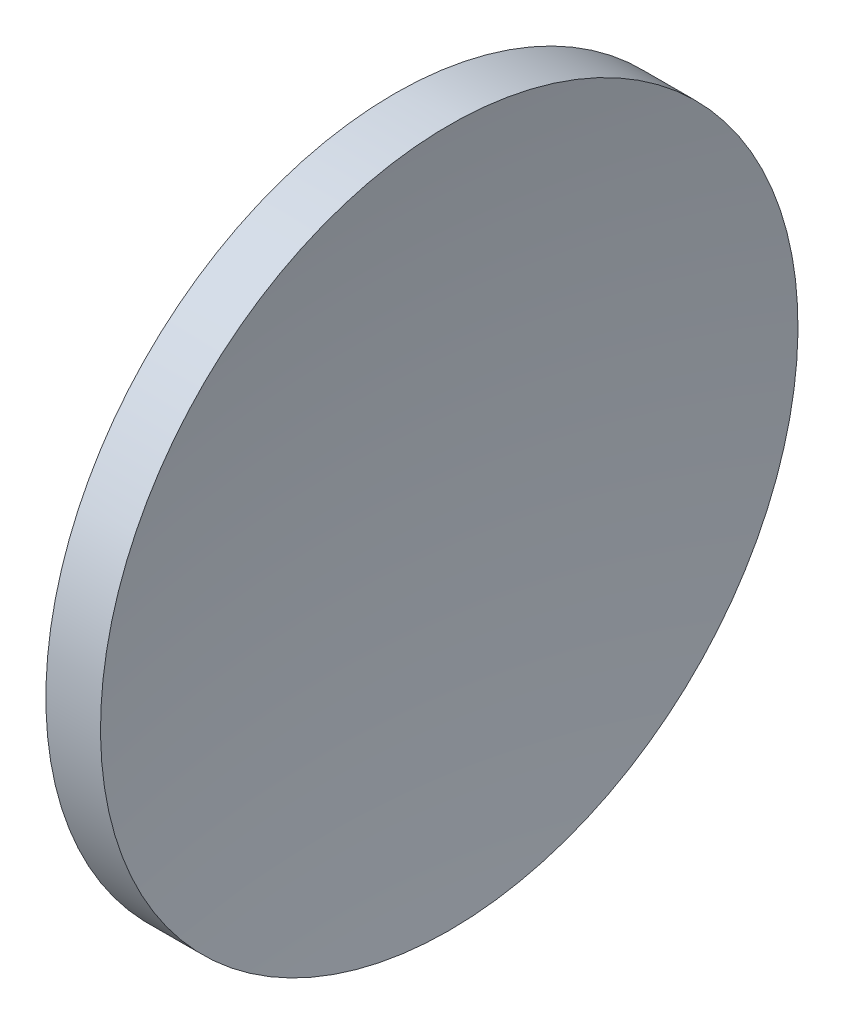
ISO-10303-21;
HEADER;
FILE_DESCRIPTION(('STEP AP214'),'2;1');
FILE_NAME('part.step','',(''),(''),'','','');
FILE_SCHEMA(('AUTOMOTIVE_DESIGN { 1 0 10303 214 1 1 1 1 }'));
ENDSEC;
DATA;
#1=APPLICATION_CONTEXT('core data for automotive mechanical design processes');
#2=APPLICATION_PROTOCOL_DEFINITION('international standard','automotive_design',2000,#1);
#3=PRODUCT_CONTEXT('',#1,'mechanical');
#4=PRODUCT('Part','Part','',(#3));
#5=PRODUCT_RELATED_PRODUCT_CATEGORY('part','',(#4));
#6=PRODUCT_DEFINITION_FORMATION('','',#4);
#7=PRODUCT_DEFINITION_CONTEXT('part definition',#1,'design');
#8=PRODUCT_DEFINITION('design','',#6,#7);
#9=PRODUCT_DEFINITION_SHAPE('','',#8);
#10=(LENGTH_UNIT() NAMED_UNIT(*) SI_UNIT(.MILLI.,.METRE.));
#11=(NAMED_UNIT(*) PLANE_ANGLE_UNIT() SI_UNIT($,.RADIAN.));
#12=(NAMED_UNIT(*) SI_UNIT($,.STERADIAN.) SOLID_ANGLE_UNIT());
#13=UNCERTAINTY_MEASURE_WITH_UNIT(LENGTH_MEASURE(1.E-05),#10,'distance_accuracy_value','');
#14=(GEOMETRIC_REPRESENTATION_CONTEXT(3) GLOBAL_UNCERTAINTY_ASSIGNED_CONTEXT((#13)) GLOBAL_UNIT_ASSIGNED_CONTEXT((#10,
#11,#12)) REPRESENTATION_CONTEXT('',''));
#15=CARTESIAN_POINT('',(0.,0.,0.));
#16=DIRECTION('',(0.,0.,1.));
#17=DIRECTION('',(1.,0.,0.));
#18=AXIS2_PLACEMENT_3D('',#15,#16,#17);
#19=CARTESIAN_POINT('',(249.955421315556,65.2168404709414,0.));
#20=DIRECTION('',(-1.,0.,0.));
#21=DIRECTION('',(0.,-1.,0.));
#22=AXIS2_PLACEMENT_3D('',#19,#20,#21);
#23=SPHERICAL_SURFACE('',#22,121.5);
#24=CARTESIAN_POINT('',(129.954173926206,65.2168404709403,0.));
#25=DIRECTION('',(-1.,0.,0.));
#26=DIRECTION('',(0.,-1.,0.));
#27=AXIS2_PLACEMENT_3D('',#24,#25,#26);
#28=CIRCLE('',#27,19.025);
#29=CARTESIAN_POINT('',(129.954173926206,46.1918404709404,0.));
#30=VERTEX_POINT('',#29);
#31=EDGE_CURVE('E10',#30,#30,#28,.T.);
#32=ORIENTED_EDGE('',*,*,#31,.F.);
#33=EDGE_LOOP('',(#32));
#34=FACE_BOUND('',#33,.T.);
#35=ADVANCED_FACE('F35',(#34),#23,.F.);
#36=CARTESIAN_POINT('',(115.944491297963,65.2168404709403,0.));
#37=DIRECTION('',(-1.,0.,0.));
#38=DIRECTION('',(0.,-1.,0.));
#39=AXIS2_PLACEMENT_3D('',#36,#37,#38);
#40=CYLINDRICAL_SURFACE('',#39,19.025);
#41=CARTESIAN_POINT('',(126.974048666131,65.2168404709403,0.));
#42=DIRECTION('',(-1.,0.,0.));
#43=DIRECTION('',(0.,-1.,0.));
#44=AXIS2_PLACEMENT_3D('',#41,#42,#43);
#45=CIRCLE('',#44,19.025);
#46=CARTESIAN_POINT('',(126.974048666131,46.1918404709403,0.));
#47=VERTEX_POINT('',#46);
#48=EDGE_CURVE('E41',#47,#47,#45,.T.);
#49=ORIENTED_EDGE('',*,*,#48,.F.);
#50=EDGE_LOOP('',(#49));
#51=FACE_BOUND('',#50,.T.);
#52=ORIENTED_EDGE('',*,*,#31,.T.);
#53=EDGE_LOOP('',(#52));
#54=FACE_BOUND('',#53,.T.);
#55=ADVANCED_FACE('F49',(#51,#54),#40,.T.);
#56=CARTESIAN_POINT('',(168.855421315556,65.2168404709403,0.));
#57=DIRECTION('',(-1.,0.,0.));
#58=DIRECTION('',(0.,1.,0.));
#59=AXIS2_PLACEMENT_3D('',#56,#57,#58);
#60=SPHERICAL_SURFACE('',#59,46.);
#61=ORIENTED_EDGE('',*,*,#48,.T.);
#62=EDGE_LOOP('',(#61));
#63=FACE_BOUND('',#62,.T.);
#64=ADVANCED_FACE('F47',(#63),#60,.T.);
#65=CLOSED_SHELL('',(#35,#55,#64));
#66=MANIFOLD_SOLID_BREP('B2',#65);
#67=ADVANCED_BREP_SHAPE_REPRESENTATION('',(#18,#66),#14);
#68=SHAPE_DEFINITION_REPRESENTATION(#9,#67);
ENDSEC;
END-ISO-10303-21;
